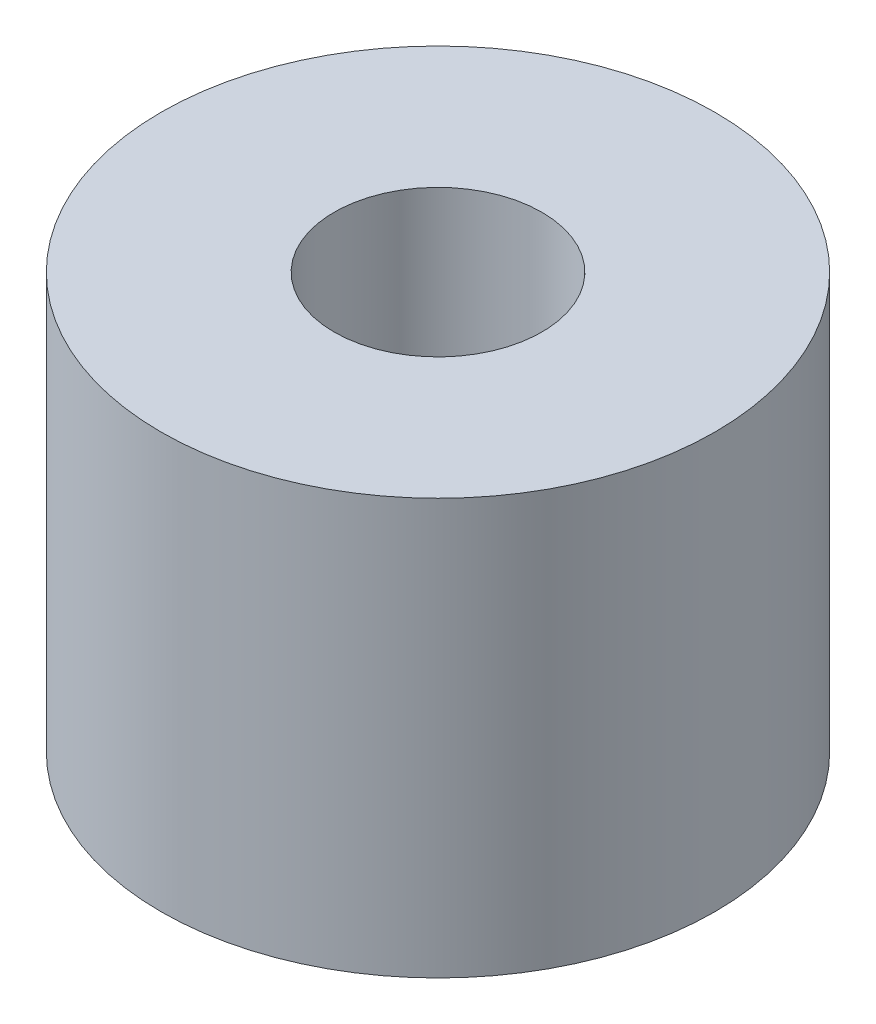
ISO-10303-21;
HEADER;
FILE_DESCRIPTION(('STEP AP214'),'2;1');
FILE_NAME('part.step','',(''),(''),'','','');
FILE_SCHEMA(('AUTOMOTIVE_DESIGN { 1 0 10303 214 1 1 1 1 }'));
ENDSEC;
DATA;
#1=APPLICATION_CONTEXT('core data for automotive mechanical design processes');
#2=APPLICATION_PROTOCOL_DEFINITION('international standard','automotive_design',2000,#1);
#3=PRODUCT_CONTEXT('',#1,'mechanical');
#4=PRODUCT('Part','Part','',(#3));
#5=PRODUCT_RELATED_PRODUCT_CATEGORY('part','',(#4));
#6=PRODUCT_DEFINITION_FORMATION('','',#4);
#7=PRODUCT_DEFINITION_CONTEXT('part definition',#1,'design');
#8=PRODUCT_DEFINITION('design','',#6,#7);
#9=PRODUCT_DEFINITION_SHAPE('','',#8);
#10=(LENGTH_UNIT() NAMED_UNIT(*) SI_UNIT(.MILLI.,.METRE.));
#11=(NAMED_UNIT(*) PLANE_ANGLE_UNIT() SI_UNIT($,.RADIAN.));
#12=(NAMED_UNIT(*) SI_UNIT($,.STERADIAN.) SOLID_ANGLE_UNIT());
#13=UNCERTAINTY_MEASURE_WITH_UNIT(LENGTH_MEASURE(1.E-05),#10,'distance_accuracy_value','');
#14=(GEOMETRIC_REPRESENTATION_CONTEXT(3) GLOBAL_UNCERTAINTY_ASSIGNED_CONTEXT((#13)) GLOBAL_UNIT_ASSIGNED_CONTEXT((#10,
#11,#12)) REPRESENTATION_CONTEXT('',''));
#15=CARTESIAN_POINT('',(0.,0.,0.));
#16=DIRECTION('',(0.,0.,1.));
#17=DIRECTION('',(1.,0.,0.));
#18=AXIS2_PLACEMENT_3D('',#15,#16,#17);
#19=CARTESIAN_POINT('',(0.,19.05,0.));
#20=DIRECTION('',(0.,1.,0.));
#21=DIRECTION('',(0.,0.,1.));
#22=AXIS2_PLACEMENT_3D('',#19,#20,#21);
#23=PLANE('',#22);
#24=CARTESIAN_POINT('',(0.,19.05,0.));
#25=DIRECTION('',(0.,1.,0.));
#26=DIRECTION('',(0.,0.,1.));
#27=AXIS2_PLACEMENT_3D('',#24,#25,#26);
#28=CIRCLE('',#27,12.7);
#29=CARTESIAN_POINT('',(0.,19.05,12.7));
#30=VERTEX_POINT('',#29);
#31=EDGE_CURVE('E10',#30,#30,#28,.T.);
#32=ORIENTED_EDGE('',*,*,#31,.T.);
#33=EDGE_LOOP('',(#32));
#34=FACE_BOUND('',#33,.T.);
#35=CARTESIAN_POINT('',(0.,19.05,0.));
#36=DIRECTION('',(0.,1.,0.));
#37=DIRECTION('',(0.,0.,1.));
#38=AXIS2_PLACEMENT_3D('',#35,#36,#37);
#39=CIRCLE('',#38,4.7625);
#40=CARTESIAN_POINT('',(0.,19.05,4.7625));
#41=VERTEX_POINT('',#40);
#42=EDGE_CURVE('E50',#41,#41,#39,.T.);
#43=ORIENTED_EDGE('',*,*,#42,.F.);
#44=EDGE_LOOP('',(#43));
#45=FACE_BOUND('',#44,.T.);
#46=ADVANCED_FACE('F37',(#34,#45),#23,.T.);
#47=CARTESIAN_POINT('',(0.,0.,0.));
#48=DIRECTION('',(0.,1.,0.));
#49=DIRECTION('',(0.,0.,1.));
#50=AXIS2_PLACEMENT_3D('',#47,#48,#49);
#51=PLANE('',#50);
#52=CARTESIAN_POINT('',(0.,0.,0.));
#53=DIRECTION('',(0.,1.,0.));
#54=DIRECTION('',(0.,0.,1.));
#55=AXIS2_PLACEMENT_3D('',#52,#53,#54);
#56=CIRCLE('',#55,12.7);
#57=CARTESIAN_POINT('',(0.,0.,12.7));
#58=VERTEX_POINT('',#57);
#59=EDGE_CURVE('E41',#58,#58,#56,.T.);
#60=ORIENTED_EDGE('',*,*,#59,.F.);
#61=EDGE_LOOP('',(#60));
#62=FACE_BOUND('',#61,.T.);
#63=CARTESIAN_POINT('',(0.,0.,0.));
#64=DIRECTION('',(0.,1.,0.));
#65=DIRECTION('',(0.,0.,1.));
#66=AXIS2_PLACEMENT_3D('',#63,#64,#65);
#67=CIRCLE('',#66,4.7625);
#68=CARTESIAN_POINT('',(0.,0.,4.7625));
#69=VERTEX_POINT('',#68);
#70=EDGE_CURVE('E52',#69,#69,#67,.T.);
#71=ORIENTED_EDGE('',*,*,#70,.T.);
#72=EDGE_LOOP('',(#71));
#73=FACE_BOUND('',#72,.T.);
#74=ADVANCED_FACE('F64',(#62,#73),#51,.F.);
#75=CARTESIAN_POINT('',(0.,19.05,0.));
#76=DIRECTION('',(0.,-1.,0.));
#77=DIRECTION('',(0.,0.,-1.));
#78=AXIS2_PLACEMENT_3D('',#75,#76,#77);
#79=CYLINDRICAL_SURFACE('',#78,12.7);
#80=ORIENTED_EDGE('',*,*,#31,.F.);
#81=EDGE_LOOP('',(#80));
#82=FACE_BOUND('',#81,.T.);
#83=ORIENTED_EDGE('',*,*,#59,.T.);
#84=EDGE_LOOP('',(#83));
#85=FACE_BOUND('',#84,.T.);
#86=ADVANCED_FACE('F39',(#82,#85),#79,.T.);
#87=CARTESIAN_POINT('',(0.,19.05,0.));
#88=DIRECTION('',(0.,-1.,0.));
#89=DIRECTION('',(0.,0.,-1.));
#90=AXIS2_PLACEMENT_3D('',#87,#88,#89);
#91=CYLINDRICAL_SURFACE('',#90,4.7625);
#92=ORIENTED_EDGE('',*,*,#42,.T.);
#93=EDGE_LOOP('',(#92));
#94=FACE_BOUND('',#93,.T.);
#95=ORIENTED_EDGE('',*,*,#70,.F.);
#96=EDGE_LOOP('',(#95));
#97=FACE_BOUND('',#96,.T.);
#98=ADVANCED_FACE('F60',(#94,#97),#91,.F.);
#99=CLOSED_SHELL('',(#46,#74,#86,#98));
#100=MANIFOLD_SOLID_BREP('B2',#99);
#101=ADVANCED_BREP_SHAPE_REPRESENTATION('',(#18,#100),#14);
#102=SHAPE_DEFINITION_REPRESENTATION(#9,#101);
ENDSEC;
END-ISO-10303-21;
